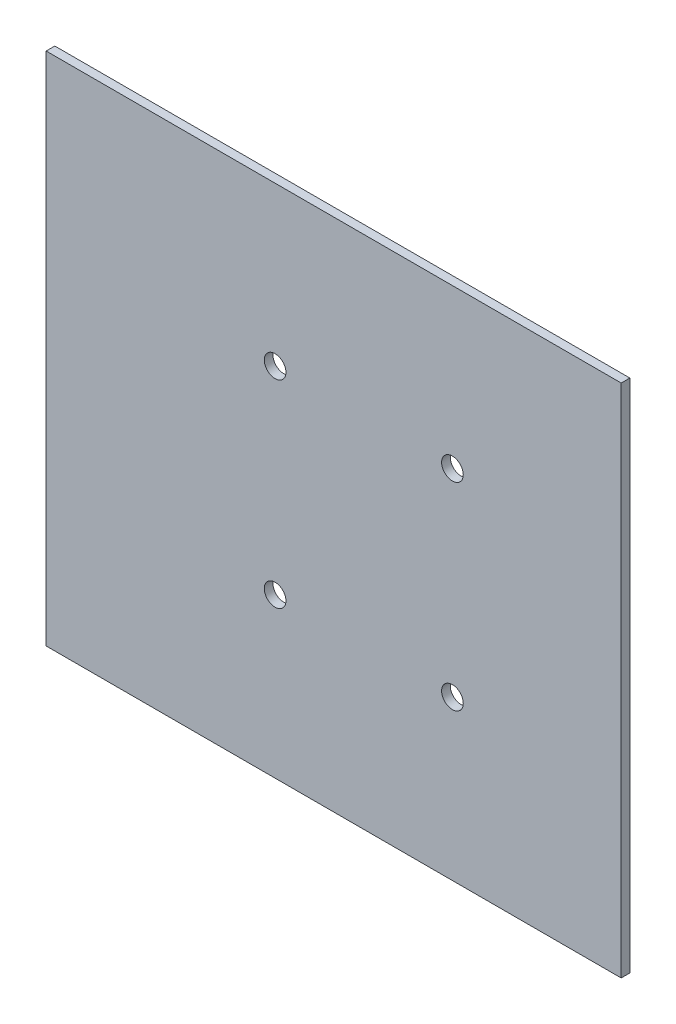
ISO-10303-21;
HEADER;
FILE_DESCRIPTION(('STEP AP214'),'2;1');
FILE_NAME('part.step','',(''),(''),'','','');
FILE_SCHEMA(('AUTOMOTIVE_DESIGN { 1 0 10303 214 1 1 1 1 }'));
ENDSEC;
DATA;
#1=APPLICATION_CONTEXT('core data for automotive mechanical design processes');
#2=APPLICATION_PROTOCOL_DEFINITION('international standard','automotive_design',2000,#1);
#3=PRODUCT_CONTEXT('',#1,'mechanical');
#4=PRODUCT('Part','Part','',(#3));
#5=PRODUCT_RELATED_PRODUCT_CATEGORY('part','',(#4));
#6=PRODUCT_DEFINITION_FORMATION('','',#4);
#7=PRODUCT_DEFINITION_CONTEXT('part definition',#1,'design');
#8=PRODUCT_DEFINITION('design','',#6,#7);
#9=PRODUCT_DEFINITION_SHAPE('','',#8);
#10=(LENGTH_UNIT() NAMED_UNIT(*) SI_UNIT(.MILLI.,.METRE.));
#11=(NAMED_UNIT(*) PLANE_ANGLE_UNIT() SI_UNIT($,.RADIAN.));
#12=(NAMED_UNIT(*) SI_UNIT($,.STERADIAN.) SOLID_ANGLE_UNIT());
#13=UNCERTAINTY_MEASURE_WITH_UNIT(LENGTH_MEASURE(1.E-05),#10,'distance_accuracy_value','');
#14=(GEOMETRIC_REPRESENTATION_CONTEXT(3) GLOBAL_UNCERTAINTY_ASSIGNED_CONTEXT((#13)) GLOBAL_UNIT_ASSIGNED_CONTEXT((#10,
#11,#12)) REPRESENTATION_CONTEXT('',''));
#15=CARTESIAN_POINT('',(0.,0.,0.));
#16=DIRECTION('',(0.,0.,1.));
#17=DIRECTION('',(1.,0.,0.));
#18=AXIS2_PLACEMENT_3D('',#15,#16,#17);
#19=CARTESIAN_POINT('',(-49.1301996215609,219.12513518129,4.2));
#20=DIRECTION('',(1.,0.,0.));
#21=DIRECTION('',(0.,1.,0.));
#22=AXIS2_PLACEMENT_3D('',#19,#20,#21);
#23=PLANE('',#22);
#24=DIRECTION('',(0.,-1.,0.));
#25=VECTOR('',#24,1.);
#26=CARTESIAN_POINT('',(-49.1301996215609,219.12513518129,0.));
#27=LINE('',#26,#25);
#28=CARTESIAN_POINT('',(-49.1301996215609,219.12513518129,0.));
#29=VERTEX_POINT('',#28);
#30=CARTESIAN_POINT('',(-49.1301996215609,-30.7748648187101,0.));
#31=VERTEX_POINT('',#30);
#32=EDGE_CURVE('E112',#29,#31,#27,.T.);
#33=ORIENTED_EDGE('',*,*,#32,.T.);
#34=DIRECTION('',(0.,0.,-1.));
#35=VECTOR('',#34,1.);
#36=CARTESIAN_POINT('',(-49.1301996215609,-30.7748648187101,4.2));
#37=LINE('',#36,#35);
#38=CARTESIAN_POINT('',(-49.1301996215609,-30.7748648187101,4.2));
#39=VERTEX_POINT('',#38);
#40=EDGE_CURVE('E11',#39,#31,#37,.T.);
#41=ORIENTED_EDGE('',*,*,#40,.F.);
#42=DIRECTION('',(0.,-1.,0.));
#43=VECTOR('',#42,1.);
#44=CARTESIAN_POINT('',(-49.1301996215609,219.12513518129,4.2));
#45=LINE('',#44,#43);
#46=CARTESIAN_POINT('',(-49.1301996215609,219.12513518129,4.2));
#47=VERTEX_POINT('',#46);
#48=EDGE_CURVE('E95',#47,#39,#45,.T.);
#49=ORIENTED_EDGE('',*,*,#48,.F.);
#50=DIRECTION('',(0.,0.,-1.));
#51=VECTOR('',#50,1.);
#52=CARTESIAN_POINT('',(-49.1301996215609,219.12513518129,4.2));
#53=LINE('',#52,#51);
#54=EDGE_CURVE('E108',#47,#29,#53,.T.);
#55=ORIENTED_EDGE('',*,*,#54,.T.);
#56=EDGE_LOOP('',(#33,#41,#49,#55));
#57=FACE_BOUND('',#56,.T.);
#58=ADVANCED_FACE('F41',(#57),#23,.F.);
#59=CARTESIAN_POINT('',(-49.1301996215609,-30.7748648187101,4.2));
#60=DIRECTION('',(0.,1.,0.));
#61=DIRECTION('',(-1.,0.,0.));
#62=AXIS2_PLACEMENT_3D('',#59,#60,#61);
#63=PLANE('',#62);
#64=DIRECTION('',(1.,0.,0.));
#65=VECTOR('',#64,1.);
#66=CARTESIAN_POINT('',(-49.1301996215609,-30.7748648187101,0.));
#67=LINE('',#66,#65);
#68=CARTESIAN_POINT('',(229.769800378439,-30.7748648187101,0.));
#69=VERTEX_POINT('',#68);
#70=EDGE_CURVE('E100',#31,#69,#67,.T.);
#71=ORIENTED_EDGE('',*,*,#70,.T.);
#72=DIRECTION('',(0.,0.,-1.));
#73=VECTOR('',#72,1.);
#74=CARTESIAN_POINT('',(229.769800378439,-30.7748648187101,4.2));
#75=LINE('',#74,#73);
#76=CARTESIAN_POINT('',(229.769800378439,-30.7748648187101,4.2));
#77=VERTEX_POINT('',#76);
#78=EDGE_CURVE('E51',#77,#69,#75,.T.);
#79=ORIENTED_EDGE('',*,*,#78,.F.);
#80=DIRECTION('',(1.,0.,0.));
#81=VECTOR('',#80,1.);
#82=CARTESIAN_POINT('',(-49.1301996215609,-30.7748648187101,4.2));
#83=LINE('',#82,#81);
#84=EDGE_CURVE('E90',#39,#77,#83,.T.);
#85=ORIENTED_EDGE('',*,*,#84,.F.);
#86=ORIENTED_EDGE('',*,*,#40,.T.);
#87=EDGE_LOOP('',(#71,#79,#85,#86));
#88=FACE_BOUND('',#87,.T.);
#89=ADVANCED_FACE('F99',(#88),#63,.F.);
#90=CARTESIAN_POINT('',(229.769800378439,219.12513518129,4.2));
#91=DIRECTION('',(-1.,0.,0.));
#92=DIRECTION('',(0.,-1.,0.));
#93=AXIS2_PLACEMENT_3D('',#90,#91,#92);
#94=PLANE('',#93);
#95=DIRECTION('',(0.,1.,0.));
#96=VECTOR('',#95,1.);
#97=CARTESIAN_POINT('',(229.769800378439,219.12513518129,0.));
#98=LINE('',#97,#96);
#99=CARTESIAN_POINT('',(229.769800378439,219.12513518129,0.));
#100=VERTEX_POINT('',#99);
#101=EDGE_CURVE('E77',#69,#100,#98,.T.);
#102=ORIENTED_EDGE('',*,*,#101,.T.);
#103=DIRECTION('',(0.,0.,-1.));
#104=VECTOR('',#103,1.);
#105=CARTESIAN_POINT('',(229.769800378439,219.12513518129,4.2));
#106=LINE('',#105,#104);
#107=CARTESIAN_POINT('',(229.769800378439,219.12513518129,4.2));
#108=VERTEX_POINT('',#107);
#109=EDGE_CURVE('E102',#108,#100,#106,.T.);
#110=ORIENTED_EDGE('',*,*,#109,.F.);
#111=DIRECTION('',(0.,1.,0.));
#112=VECTOR('',#111,1.);
#113=CARTESIAN_POINT('',(229.769800378439,219.12513518129,4.2));
#114=LINE('',#113,#112);
#115=EDGE_CURVE('E93',#77,#108,#114,.T.);
#116=ORIENTED_EDGE('',*,*,#115,.F.);
#117=ORIENTED_EDGE('',*,*,#78,.T.);
#118=EDGE_LOOP('',(#102,#110,#116,#117));
#119=FACE_BOUND('',#118,.T.);
#120=ADVANCED_FACE('F104',(#119),#94,.F.);
#121=CARTESIAN_POINT('',(-49.1301996215609,219.12513518129,4.2));
#122=DIRECTION('',(0.,-1.,0.));
#123=DIRECTION('',(0.,0.,-1.));
#124=AXIS2_PLACEMENT_3D('',#121,#122,#123);
#125=PLANE('',#124);
#126=DIRECTION('',(-1.,0.,0.));
#127=VECTOR('',#126,1.);
#128=CARTESIAN_POINT('',(-49.1301996215609,219.12513518129,0.));
#129=LINE('',#128,#127);
#130=EDGE_CURVE('E83',#100,#29,#129,.T.);
#131=ORIENTED_EDGE('',*,*,#130,.T.);
#132=ORIENTED_EDGE('',*,*,#54,.F.);
#133=DIRECTION('',(-1.,0.,0.));
#134=VECTOR('',#133,1.);
#135=CARTESIAN_POINT('',(-49.1301996215609,219.12513518129,4.2));
#136=LINE('',#135,#134);
#137=EDGE_CURVE('E60',#108,#47,#136,.T.);
#138=ORIENTED_EDGE('',*,*,#137,.F.);
#139=ORIENTED_EDGE('',*,*,#109,.T.);
#140=EDGE_LOOP('',(#131,#132,#138,#139));
#141=FACE_BOUND('',#140,.T.);
#142=ADVANCED_FACE('F174',(#141),#125,.F.);
#143=CARTESIAN_POINT('',(0.,0.,4.2));
#144=DIRECTION('',(0.,0.,1.));
#145=DIRECTION('',(1.,0.,0.));
#146=AXIS2_PLACEMENT_3D('',#143,#144,#145);
#147=PLANE('',#146);
#148=CARTESIAN_POINT('',(61.9198003784424,46.2751351812922,4.2));
#149=DIRECTION('',(0.,0.,1.));
#150=DIRECTION('',(1.,0.,0.));
#151=AXIS2_PLACEMENT_3D('',#148,#149,#150);
#152=CIRCLE('',#151,5.25);
#153=CARTESIAN_POINT('',(67.1698003784424,46.2751351812922,4.2));
#154=VERTEX_POINT('',#153);
#155=EDGE_CURVE('E240',#154,#154,#152,.T.);
#156=ORIENTED_EDGE('',*,*,#155,.F.);
#157=EDGE_LOOP('',(#156));
#158=FACE_BOUND('',#157,.T.);
#159=CARTESIAN_POINT('',(147.919800378442,142.275135181292,4.2));
#160=DIRECTION('',(0.,0.,1.));
#161=DIRECTION('',(1.,0.,0.));
#162=AXIS2_PLACEMENT_3D('',#159,#160,#161);
#163=CIRCLE('',#162,5.25);
#164=CARTESIAN_POINT('',(153.169800378442,142.275135181292,4.2));
#165=VERTEX_POINT('',#164);
#166=EDGE_CURVE('E236',#165,#165,#163,.T.);
#167=ORIENTED_EDGE('',*,*,#166,.F.);
#168=EDGE_LOOP('',(#167));
#169=FACE_BOUND('',#168,.T.);
#170=CARTESIAN_POINT('',(147.919800378442,46.2751351812925,4.2));
#171=DIRECTION('',(0.,0.,1.));
#172=DIRECTION('',(1.,0.,0.));
#173=AXIS2_PLACEMENT_3D('',#170,#171,#172);
#174=CIRCLE('',#173,5.25);
#175=CARTESIAN_POINT('',(153.169800378442,46.2751351812925,4.2));
#176=VERTEX_POINT('',#175);
#177=EDGE_CURVE('E228',#176,#176,#174,.T.);
#178=ORIENTED_EDGE('',*,*,#177,.F.);
#179=EDGE_LOOP('',(#178));
#180=FACE_BOUND('',#179,.T.);
#181=CARTESIAN_POINT('',(61.9198003784421,142.275135181292,4.2));
#182=DIRECTION('',(0.,0.,1.));
#183=DIRECTION('',(1.,0.,0.));
#184=AXIS2_PLACEMENT_3D('',#181,#182,#183);
#185=CIRCLE('',#184,5.25);
#186=CARTESIAN_POINT('',(67.1698003784421,142.275135181292,4.2));
#187=VERTEX_POINT('',#186);
#188=EDGE_CURVE('E131',#187,#187,#185,.T.);
#189=ORIENTED_EDGE('',*,*,#188,.F.);
#190=EDGE_LOOP('',(#189));
#191=FACE_BOUND('',#190,.T.);
#192=ORIENTED_EDGE('',*,*,#48,.T.);
#193=ORIENTED_EDGE('',*,*,#84,.T.);
#194=ORIENTED_EDGE('',*,*,#115,.T.);
#195=ORIENTED_EDGE('',*,*,#137,.T.);
#196=EDGE_LOOP('',(#192,#193,#194,#195));
#197=FACE_BOUND('',#196,.T.);
#198=ADVANCED_FACE('F91',(#158,#169,#180,#191,#197),#147,.T.);
#199=CARTESIAN_POINT('',(0.,0.,0.));
#200=DIRECTION('',(0.,0.,1.));
#201=DIRECTION('',(1.,0.,0.));
#202=AXIS2_PLACEMENT_3D('',#199,#200,#201);
#203=PLANE('',#202);
#204=CARTESIAN_POINT('',(61.9198003784424,46.2751351812922,0.));
#205=DIRECTION('',(0.,0.,1.));
#206=DIRECTION('',(1.,0.,0.));
#207=AXIS2_PLACEMENT_3D('',#204,#205,#206);
#208=CIRCLE('',#207,5.25);
#209=CARTESIAN_POINT('',(67.1698003784424,46.2751351812922,0.));
#210=VERTEX_POINT('',#209);
#211=EDGE_CURVE('E44',#210,#210,#208,.T.);
#212=ORIENTED_EDGE('',*,*,#211,.T.);
#213=EDGE_LOOP('',(#212));
#214=FACE_BOUND('',#213,.T.);
#215=CARTESIAN_POINT('',(147.919800378442,142.275135181292,0.));
#216=DIRECTION('',(0.,0.,1.));
#217=DIRECTION('',(1.,0.,0.));
#218=AXIS2_PLACEMENT_3D('',#215,#216,#217);
#219=CIRCLE('',#218,5.25);
#220=CARTESIAN_POINT('',(153.169800378442,142.275135181292,0.));
#221=VERTEX_POINT('',#220);
#222=EDGE_CURVE('E134',#221,#221,#219,.T.);
#223=ORIENTED_EDGE('',*,*,#222,.T.);
#224=EDGE_LOOP('',(#223));
#225=FACE_BOUND('',#224,.T.);
#226=CARTESIAN_POINT('',(147.919800378442,46.2751351812925,0.));
#227=DIRECTION('',(0.,0.,1.));
#228=DIRECTION('',(1.,0.,0.));
#229=AXIS2_PLACEMENT_3D('',#226,#227,#228);
#230=CIRCLE('',#229,5.25);
#231=CARTESIAN_POINT('',(153.169800378442,46.2751351812925,0.));
#232=VERTEX_POINT('',#231);
#233=EDGE_CURVE('E130',#232,#232,#230,.T.);
#234=ORIENTED_EDGE('',*,*,#233,.T.);
#235=EDGE_LOOP('',(#234));
#236=FACE_BOUND('',#235,.T.);
#237=CARTESIAN_POINT('',(61.9198003784421,142.275135181292,0.));
#238=DIRECTION('',(0.,0.,1.));
#239=DIRECTION('',(1.,0.,0.));
#240=AXIS2_PLACEMENT_3D('',#237,#238,#239);
#241=CIRCLE('',#240,5.25);
#242=CARTESIAN_POINT('',(67.1698003784421,142.275135181292,0.));
#243=VERTEX_POINT('',#242);
#244=EDGE_CURVE('E126',#243,#243,#241,.T.);
#245=ORIENTED_EDGE('',*,*,#244,.T.);
#246=EDGE_LOOP('',(#245));
#247=FACE_BOUND('',#246,.T.);
#248=ORIENTED_EDGE('',*,*,#32,.F.);
#249=ORIENTED_EDGE('',*,*,#130,.F.);
#250=ORIENTED_EDGE('',*,*,#101,.F.);
#251=ORIENTED_EDGE('',*,*,#70,.F.);
#252=EDGE_LOOP('',(#248,#249,#250,#251));
#253=FACE_BOUND('',#252,.T.);
#254=ADVANCED_FACE('F143',(#214,#225,#236,#247,#253),#203,.F.);
#255=CARTESIAN_POINT('',(61.9198003784421,142.275135181292,-0.799999999999999));
#256=DIRECTION('',(0.,0.,1.));
#257=DIRECTION('',(1.,0.,0.));
#258=AXIS2_PLACEMENT_3D('',#255,#256,#257);
#259=CYLINDRICAL_SURFACE('',#258,5.25);
#260=ORIENTED_EDGE('',*,*,#188,.T.);
#261=EDGE_LOOP('',(#260));
#262=FACE_BOUND('',#261,.T.);
#263=ORIENTED_EDGE('',*,*,#244,.F.);
#264=EDGE_LOOP('',(#263));
#265=FACE_BOUND('',#264,.T.);
#266=ADVANCED_FACE('F166',(#262,#265),#259,.F.);
#267=CARTESIAN_POINT('',(147.919800378442,46.2751351812925,-0.799999999999999));
#268=DIRECTION('',(0.,0.,1.));
#269=DIRECTION('',(1.,0.,0.));
#270=AXIS2_PLACEMENT_3D('',#267,#268,#269);
#271=CYLINDRICAL_SURFACE('',#270,5.25);
#272=ORIENTED_EDGE('',*,*,#177,.T.);
#273=EDGE_LOOP('',(#272));
#274=FACE_BOUND('',#273,.T.);
#275=ORIENTED_EDGE('',*,*,#233,.F.);
#276=EDGE_LOOP('',(#275));
#277=FACE_BOUND('',#276,.T.);
#278=ADVANCED_FACE('F153',(#274,#277),#271,.F.);
#279=CARTESIAN_POINT('',(147.919800378442,142.275135181292,-0.799999999999999));
#280=DIRECTION('',(0.,0.,1.));
#281=DIRECTION('',(1.,0.,0.));
#282=AXIS2_PLACEMENT_3D('',#279,#280,#281);
#283=CYLINDRICAL_SURFACE('',#282,5.25);
#284=ORIENTED_EDGE('',*,*,#166,.T.);
#285=EDGE_LOOP('',(#284));
#286=FACE_BOUND('',#285,.T.);
#287=ORIENTED_EDGE('',*,*,#222,.F.);
#288=EDGE_LOOP('',(#287));
#289=FACE_BOUND('',#288,.T.);
#290=ADVANCED_FACE('F147',(#286,#289),#283,.F.);
#291=CARTESIAN_POINT('',(61.9198003784424,46.2751351812922,-0.799999999999999));
#292=DIRECTION('',(0.,0.,1.));
#293=DIRECTION('',(1.,0.,0.));
#294=AXIS2_PLACEMENT_3D('',#291,#292,#293);
#295=CYLINDRICAL_SURFACE('',#294,5.25);
#296=ORIENTED_EDGE('',*,*,#155,.T.);
#297=EDGE_LOOP('',(#296));
#298=FACE_BOUND('',#297,.T.);
#299=ORIENTED_EDGE('',*,*,#211,.F.);
#300=EDGE_LOOP('',(#299));
#301=FACE_BOUND('',#300,.T.);
#302=ADVANCED_FACE('F145',(#298,#301),#295,.F.);
#303=CLOSED_SHELL('',(#58,#89,#120,#142,#198,#254,#266,#278,#290,#302));
#304=MANIFOLD_SOLID_BREP('B2',#303);
#305=ADVANCED_BREP_SHAPE_REPRESENTATION('',(#18,#304),#14);
#306=SHAPE_DEFINITION_REPRESENTATION(#9,#305);
ENDSEC;
END-ISO-10303-21;
